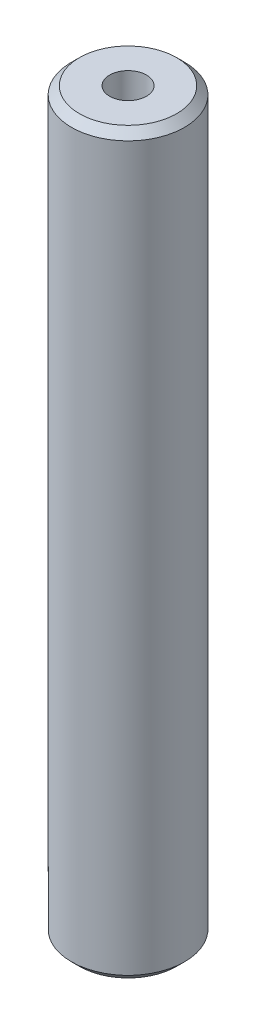
ISO-10303-21;
HEADER;
FILE_DESCRIPTION(('STEP AP214'),'2;1');
FILE_NAME('part.step','',(''),(''),'','','');
FILE_SCHEMA(('AUTOMOTIVE_DESIGN { 1 0 10303 214 1 1 1 1 }'));
ENDSEC;
DATA;
#1=APPLICATION_CONTEXT('core data for automotive mechanical design processes');
#2=APPLICATION_PROTOCOL_DEFINITION('international standard','automotive_design',2000,#1);
#3=PRODUCT_CONTEXT('',#1,'mechanical');
#4=PRODUCT('Part','Part','',(#3));
#5=PRODUCT_RELATED_PRODUCT_CATEGORY('part','',(#4));
#6=PRODUCT_DEFINITION_FORMATION('','',#4);
#7=PRODUCT_DEFINITION_CONTEXT('part definition',#1,'design');
#8=PRODUCT_DEFINITION('design','',#6,#7);
#9=PRODUCT_DEFINITION_SHAPE('','',#8);
#10=(LENGTH_UNIT() NAMED_UNIT(*) SI_UNIT(.MILLI.,.METRE.));
#11=(NAMED_UNIT(*) PLANE_ANGLE_UNIT() SI_UNIT($,.RADIAN.));
#12=(NAMED_UNIT(*) SI_UNIT($,.STERADIAN.) SOLID_ANGLE_UNIT());
#13=UNCERTAINTY_MEASURE_WITH_UNIT(LENGTH_MEASURE(1.E-05),#10,'distance_accuracy_value','');
#14=(GEOMETRIC_REPRESENTATION_CONTEXT(3) GLOBAL_UNCERTAINTY_ASSIGNED_CONTEXT((#13)) GLOBAL_UNIT_ASSIGNED_CONTEXT((#10,
#11,#12)) REPRESENTATION_CONTEXT('',''));
#15=CARTESIAN_POINT('',(0.,0.,0.));
#16=DIRECTION('',(0.,0.,1.));
#17=DIRECTION('',(1.,0.,0.));
#18=AXIS2_PLACEMENT_3D('',#15,#16,#17);
#19=CARTESIAN_POINT('',(0.,359.332639634104,0.));
#20=DIRECTION('',(0.,-1.,0.));
#21=DIRECTION('',(0.,0.,-1.));
#22=AXIS2_PLACEMENT_3D('',#19,#20,#21);
#23=CYLINDRICAL_SURFACE('',#22,27.5);
#24=CARTESIAN_POINT('',(0.,355.488390435707,0.));
#25=DIRECTION('',(0.,1.,0.));
#26=DIRECTION('',(0.,0.,1.));
#27=AXIS2_PLACEMENT_3D('',#24,#25,#26);
#28=CIRCLE('',#27,27.5);
#29=CARTESIAN_POINT('',(0.,355.488390435707,-27.5));
#30=VERTEX_POINT('',#29);
#31=EDGE_CURVE('E50',#30,#30,#28,.F.);
#32=ORIENTED_EDGE('',*,*,#31,.T.);
#33=EDGE_LOOP('',(#32));
#34=FACE_BOUND('',#33,.T.);
#35=CARTESIAN_POINT('',(0.,3.84424919839715,0.));
#36=DIRECTION('',(0.,1.,0.));
#37=DIRECTION('',(0.,0.,1.));
#38=AXIS2_PLACEMENT_3D('',#35,#36,#37);
#39=CIRCLE('',#38,27.5);
#40=CARTESIAN_POINT('',(0.,3.84424919839715,27.5));
#41=VERTEX_POINT('',#40);
#42=EDGE_CURVE('E51',#41,#41,#39,.T.);
#43=ORIENTED_EDGE('',*,*,#42,.T.);
#44=EDGE_LOOP('',(#43));
#45=FACE_BOUND('',#44,.T.);
#46=ADVANCED_FACE('F39',(#34,#45),#23,.T.);
#47=CARTESIAN_POINT('',(0.,359.332639634104,0.));
#48=DIRECTION('',(0.,1.,0.));
#49=DIRECTION('',(0.,0.,1.));
#50=AXIS2_PLACEMENT_3D('',#47,#48,#49);
#51=PLANE('',#50);
#52=CARTESIAN_POINT('',(0.,359.332639634104,0.));
#53=DIRECTION('',(0.,1.,0.));
#54=DIRECTION('',(0.,0.,1.));
#55=AXIS2_PLACEMENT_3D('',#52,#53,#54);
#56=CIRCLE('',#55,23.6557508016027);
#57=CARTESIAN_POINT('',(0.,359.332639634104,-23.6557508016027));
#58=VERTEX_POINT('',#57);
#59=EDGE_CURVE('E54',#58,#58,#56,.T.);
#60=ORIENTED_EDGE('',*,*,#59,.T.);
#61=EDGE_LOOP('',(#60));
#62=FACE_BOUND('',#61,.T.);
#63=CARTESIAN_POINT('',(0.,359.332639634104,0.));
#64=DIRECTION('',(0.,1.,0.));
#65=DIRECTION('',(0.,0.,1.));
#66=AXIS2_PLACEMENT_3D('',#63,#64,#65);
#67=CIRCLE('',#66,8.95964828468272);
#68=CARTESIAN_POINT('',(0.,359.332639634104,8.95964828468272));
#69=VERTEX_POINT('',#68);
#70=EDGE_CURVE('E58',#69,#69,#67,.T.);
#71=ORIENTED_EDGE('',*,*,#70,.F.);
#72=EDGE_LOOP('',(#71));
#73=FACE_BOUND('',#72,.T.);
#74=ADVANCED_FACE('F69',(#62,#73),#51,.T.);
#75=CARTESIAN_POINT('',(0.,0.,0.));
#76=DIRECTION('',(0.,1.,0.));
#77=DIRECTION('',(0.,0.,1.));
#78=AXIS2_PLACEMENT_3D('',#75,#76,#77);
#79=PLANE('',#78);
#80=CARTESIAN_POINT('',(0.,0.,0.));
#81=DIRECTION('',(0.,1.,0.));
#82=DIRECTION('',(0.,0.,1.));
#83=AXIS2_PLACEMENT_3D('',#80,#81,#82);
#84=CIRCLE('',#83,23.6557508016029);
#85=CARTESIAN_POINT('',(0.,0.,23.6557508016029));
#86=VERTEX_POINT('',#85);
#87=EDGE_CURVE('E10',#86,#86,#84,.F.);
#88=ORIENTED_EDGE('',*,*,#87,.T.);
#89=EDGE_LOOP('',(#88));
#90=FACE_BOUND('',#89,.T.);
#91=CARTESIAN_POINT('',(0.,0.,0.));
#92=DIRECTION('',(0.,1.,0.));
#93=DIRECTION('',(0.,0.,1.));
#94=AXIS2_PLACEMENT_3D('',#91,#92,#93);
#95=CIRCLE('',#94,8.95964828468272);
#96=CARTESIAN_POINT('',(0.,0.,8.95964828468272));
#97=VERTEX_POINT('',#96);
#98=EDGE_CURVE('E63',#97,#97,#95,.T.);
#99=ORIENTED_EDGE('',*,*,#98,.T.);
#100=EDGE_LOOP('',(#99));
#101=FACE_BOUND('',#100,.T.);
#102=ADVANCED_FACE('F75',(#90,#101),#79,.F.);
#103=CARTESIAN_POINT('',(0.,359.332639634104,0.));
#104=DIRECTION('',(0.,-1.,0.));
#105=DIRECTION('',(0.,0.,-1.));
#106=AXIS2_PLACEMENT_3D('',#103,#104,#105);
#107=CYLINDRICAL_SURFACE('',#106,8.95964828468272);
#108=ORIENTED_EDGE('',*,*,#70,.T.);
#109=EDGE_LOOP('',(#108));
#110=FACE_BOUND('',#109,.T.);
#111=ORIENTED_EDGE('',*,*,#98,.F.);
#112=EDGE_LOOP('',(#111));
#113=FACE_BOUND('',#112,.T.);
#114=ADVANCED_FACE('F70',(#110,#113),#107,.F.);
#115=CARTESIAN_POINT('',(0.,359.332639634104,0.));
#116=DIRECTION('',(0.,-1.,0.));
#117=DIRECTION('',(0.,0.,-1.));
#118=AXIS2_PLACEMENT_3D('',#115,#116,#117);
#119=CONICAL_SURFACE('',#118,23.6557508016027,0.785398163397452);
#120=CARTESIAN_POINT('',(0.,355.488390435707,-27.5));
#121=CARTESIAN_POINT('',(0.,355.52843469819,-27.4599557375167));
#122=CARTESIAN_POINT('',(0.,355.568478960673,-27.4199114750334));
#123=CARTESIAN_POINT('',(0.,355.64856748564,-27.3398229500668));
#124=CARTESIAN_POINT('',(0.,355.688611748123,-27.2997786875835));
#125=CARTESIAN_POINT('',(0.,355.76870027309,-27.2196901626169));
#126=CARTESIAN_POINT('',(0.,355.808744535573,-27.1796459001336));
#127=CARTESIAN_POINT('',(0.,355.88883306054,-27.099557375167));
#128=CARTESIAN_POINT('',(0.,355.928877323023,-27.0595131126837));
#129=CARTESIAN_POINT('',(0.,356.00896584799,-26.9794245877171));
#130=CARTESIAN_POINT('',(0.,356.049010110473,-26.9393803252338));
#131=CARTESIAN_POINT('',(0.,356.12909863544,-26.8592918002672));
#132=CARTESIAN_POINT('',(0.,356.169142897923,-26.8192475377838));
#133=CARTESIAN_POINT('',(0.,356.24923142289,-26.7391590128172));
#134=CARTESIAN_POINT('',(0.,356.289275685373,-26.6991147503339));
#135=CARTESIAN_POINT('',(0.,356.36936421034,-26.6190262253673));
#136=CARTESIAN_POINT('',(0.,356.409408472823,-26.578981962884));
#137=CARTESIAN_POINT('',(0.,356.489496997789,-26.4988934379174));
#138=CARTESIAN_POINT('',(0.,356.529541260273,-26.4588491754341));
#139=CARTESIAN_POINT('',(0.,356.609629785239,-26.3787606504675));
#140=CARTESIAN_POINT('',(0.,356.649674047723,-26.3387163879842));
#141=CARTESIAN_POINT('',(0.,356.729762572689,-26.2586278630176));
#142=CARTESIAN_POINT('',(0.,356.769806835173,-26.2185836005343));
#143=CARTESIAN_POINT('',(0.,356.849895360139,-26.1384950755677));
#144=CARTESIAN_POINT('',(0.,356.889939622622,-26.0984508130843));
#145=CARTESIAN_POINT('',(0.,356.970028147589,-26.0183622881177));
#146=CARTESIAN_POINT('',(0.,357.010072410072,-25.9783180256344));
#147=CARTESIAN_POINT('',(0.,357.090160935039,-25.8982295006678));
#148=CARTESIAN_POINT('',(0.,357.130205197522,-25.8581852381845));
#149=CARTESIAN_POINT('',(0.,357.210293722489,-25.7780967132179));
#150=CARTESIAN_POINT('',(0.,357.250337984972,-25.7380524507346));
#151=CARTESIAN_POINT('',(0.,357.330426509939,-25.657963925768));
#152=CARTESIAN_POINT('',(0.,357.370470772422,-25.6179196632847));
#153=CARTESIAN_POINT('',(0.,357.450559297389,-25.5378311383181));
#154=CARTESIAN_POINT('',(0.,357.490603559872,-25.4977868758348));
#155=CARTESIAN_POINT('',(0.,357.570692084839,-25.4176983508682));
#156=CARTESIAN_POINT('',(0.,357.610736347322,-25.3776540883849));
#157=CARTESIAN_POINT('',(0.,357.690824872289,-25.2975655634182));
#158=CARTESIAN_POINT('',(0.,357.730869134772,-25.2575213009349));
#159=CARTESIAN_POINT('',(0.,357.810957659739,-25.1774327759683));
#160=CARTESIAN_POINT('',(0.,357.851001922222,-25.137388513485));
#161=CARTESIAN_POINT('',(0.,357.931090447188,-25.0572999885184));
#162=CARTESIAN_POINT('',(0.,357.971134709672,-25.0172557260351));
#163=CARTESIAN_POINT('',(0.,358.051223234638,-24.9371672010685));
#164=CARTESIAN_POINT('',(0.,358.091267497122,-24.8971229385852));
#165=CARTESIAN_POINT('',(0.,358.171356022088,-24.8170344136186));
#166=CARTESIAN_POINT('',(0.,358.211400284572,-24.7769901511353));
#167=CARTESIAN_POINT('',(0.,358.291488809538,-24.6969016261687));
#168=CARTESIAN_POINT('',(0.,358.331533072022,-24.6568573636854));
#169=CARTESIAN_POINT('',(0.,358.411621596988,-24.5767688387187));
#170=CARTESIAN_POINT('',(0.,358.451665859471,-24.5367245762354));
#171=CARTESIAN_POINT('',(0.,358.531754384438,-24.4566360512688));
#172=CARTESIAN_POINT('',(0.,358.571798646921,-24.4165917887855));
#173=CARTESIAN_POINT('',(0.,358.651887171888,-24.3365032638189));
#174=CARTESIAN_POINT('',(0.,358.691931434371,-24.2964590013356));
#175=CARTESIAN_POINT('',(0.,358.772019959338,-24.216370476369));
#176=CARTESIAN_POINT('',(0.,358.812064221821,-24.1763262138857));
#177=CARTESIAN_POINT('',(0.,358.892152746788,-24.0962376889191));
#178=CARTESIAN_POINT('',(0.,358.932197009271,-24.0561934264358));
#179=CARTESIAN_POINT('',(0.,359.012285534238,-23.9761049014692));
#180=CARTESIAN_POINT('',(0.,359.052329796721,-23.9360606389859));
#181=CARTESIAN_POINT('',(0.,359.132418321688,-23.8559721140193));
#182=CARTESIAN_POINT('',(0.,359.172462584171,-23.815927851536));
#183=CARTESIAN_POINT('',(0.,359.252551109138,-23.7358393265693));
#184=CARTESIAN_POINT('',(0.,359.292595371621,-23.695795064086));
#185=CARTESIAN_POINT('',(0.,359.332639634104,-23.6557508016027));
#186=B_SPLINE_CURVE_WITH_KNOTS('',3,(#120,#121,#122,#123,#124,#125,#126,#127,#128,#129,#130,
#131,#132,#133,#134,#135,#136,#137,#138,#139,#140,#141,#142,#143,#144,#145,#146,#147,#148,#149,
#150,#151,#152,#153,#154,#155,#156,#157,#158,#159,#160,#161,#162,#163,#164,#165,#166,#167,#168,
#169,#170,#171,#172,#173,#174,#175,#176,#177,#178,#179,#180,#181,#182,#183,#184,#185),
.UNSPECIFIED.,.F.,.F.,(4,2,2,2,2,2,2,2,2,2,2,2,2,2,2,2,2,2,2,2,2,2,2,2,2,2,2,2,2,2,2,2,4),(0.,
0.169893417297329,0.339786834594697,0.509680251892024,0.679573669189392,0.84946708648676,
1.01936050378409,1.18925392108145,1.35914733837882,1.52904075567615,1.69893417297352,
1.86882759027089,2.03872100756821,2.20861442486558,2.37850784216295,2.54840125946028,
2.71829467675765,2.88818809405501,3.05808151135234,3.22797492864971,3.39786834594708,
3.56776176324441,3.73765518054177,3.90754859783914,4.07744201513647,4.24733543243384,
4.4172288497312,4.58712226702853,4.7570156843259,4.92690910162327,5.0968025189206,
5.26669593621796,5.43658935351533),.UNSPECIFIED.);
#187=EDGE_CURVE('BSEAM81',#30,#58,#186,.T.);
#188=ORIENTED_EDGE('',*,*,#31,.F.);
#189=ORIENTED_EDGE('',*,*,#59,.F.);
#190=ORIENTED_EDGE('',*,*,#187,.T.);
#191=ORIENTED_EDGE('',*,*,#187,.F.);
#192=EDGE_LOOP('',(#188,#190,#189,#191));
#193=FACE_BOUND('',#192,.T.);
#194=ADVANCED_FACE('F81',(#193),#119,.T.);
#195=CARTESIAN_POINT('',(0.,3.84424919839715,0.));
#196=DIRECTION('',(0.,1.,0.));
#197=DIRECTION('',(0.,0.,1.));
#198=AXIS2_PLACEMENT_3D('',#195,#196,#197);
#199=CONICAL_SURFACE('',#198,27.5,0.785398163397446);
#200=ORIENTED_EDGE('',*,*,#87,.F.);
#201=EDGE_LOOP('',(#200));
#202=FACE_BOUND('',#201,.T.);
#203=ORIENTED_EDGE('',*,*,#42,.F.);
#204=EDGE_LOOP('',(#203));
#205=FACE_BOUND('',#204,.T.);
#206=ADVANCED_FACE('F45',(#202,#205),#199,.T.);
#207=CLOSED_SHELL('',(#46,#74,#102,#114,#194,#206));
#208=MANIFOLD_SOLID_BREP('B2',#207);
#209=ADVANCED_BREP_SHAPE_REPRESENTATION('',(#18,#208),#14);
#210=SHAPE_DEFINITION_REPRESENTATION(#9,#209);
ENDSEC;
END-ISO-10303-21;
